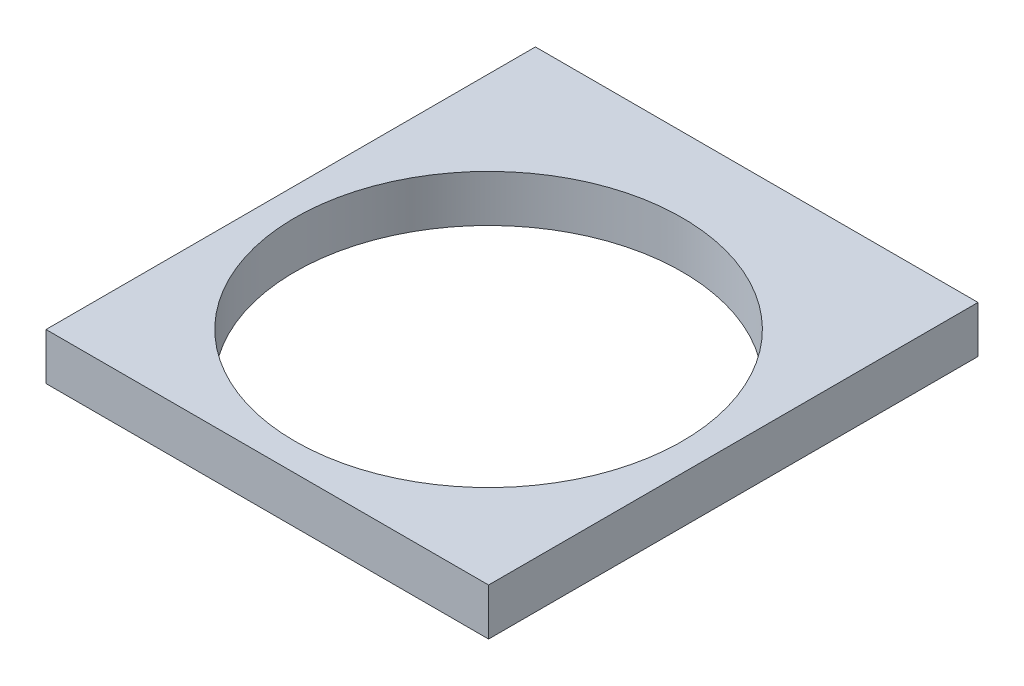
ISO-10303-21;
HEADER;
FILE_DESCRIPTION(('STEP AP214'),'2;1');
FILE_NAME('part.step','',(''),(''),'','','');
FILE_SCHEMA(('AUTOMOTIVE_DESIGN { 1 0 10303 214 1 1 1 1 }'));
ENDSEC;
DATA;
#1=APPLICATION_CONTEXT('core data for automotive mechanical design processes');
#2=APPLICATION_PROTOCOL_DEFINITION('international standard','automotive_design',2000,#1);
#3=PRODUCT_CONTEXT('',#1,'mechanical');
#4=PRODUCT('Part','Part','',(#3));
#5=PRODUCT_RELATED_PRODUCT_CATEGORY('part','',(#4));
#6=PRODUCT_DEFINITION_FORMATION('','',#4);
#7=PRODUCT_DEFINITION_CONTEXT('part definition',#1,'design');
#8=PRODUCT_DEFINITION('design','',#6,#7);
#9=PRODUCT_DEFINITION_SHAPE('','',#8);
#10=(LENGTH_UNIT() NAMED_UNIT(*) SI_UNIT(.MILLI.,.METRE.));
#11=(NAMED_UNIT(*) PLANE_ANGLE_UNIT() SI_UNIT($,.RADIAN.));
#12=(NAMED_UNIT(*) SI_UNIT($,.STERADIAN.) SOLID_ANGLE_UNIT());
#13=UNCERTAINTY_MEASURE_WITH_UNIT(LENGTH_MEASURE(1.E-05),#10,'distance_accuracy_value','');
#14=(GEOMETRIC_REPRESENTATION_CONTEXT(3) GLOBAL_UNCERTAINTY_ASSIGNED_CONTEXT((#13)) GLOBAL_UNIT_ASSIGNED_CONTEXT((#10,
#11,#12)) REPRESENTATION_CONTEXT('',''));
#15=CARTESIAN_POINT('',(0.,0.,0.));
#16=DIRECTION('',(0.,0.,1.));
#17=DIRECTION('',(1.,0.,0.));
#18=AXIS2_PLACEMENT_3D('',#15,#16,#17);
#19=CARTESIAN_POINT('',(0.,6.35,0.));
#20=DIRECTION('',(0.,-1.,0.));
#21=DIRECTION('',(0.,0.,-1.));
#22=AXIS2_PLACEMENT_3D('',#19,#20,#21);
#23=PLANE('',#22);
#24=DIRECTION('',(0.,0.,1.));
#25=VECTOR('',#24,1.);
#26=CARTESIAN_POINT('',(-30.,6.35,30.));
#27=LINE('',#26,#25);
#28=CARTESIAN_POINT('',(-30.,6.35,-36.35));
#29=VERTEX_POINT('',#28);
#30=CARTESIAN_POINT('',(-30.,6.35,30.));
#31=VERTEX_POINT('',#30);
#32=EDGE_CURVE('E50',#29,#31,#27,.T.);
#33=ORIENTED_EDGE('',*,*,#32,.T.);
#34=DIRECTION('',(1.,0.,0.));
#35=VECTOR('',#34,1.);
#36=CARTESIAN_POINT('',(30.,6.35,30.));
#37=LINE('',#36,#35);
#38=CARTESIAN_POINT('',(30.,6.35,30.));
#39=VERTEX_POINT('',#38);
#40=EDGE_CURVE('E80',#31,#39,#37,.T.);
#41=ORIENTED_EDGE('',*,*,#40,.T.);
#42=DIRECTION('',(0.,0.,-1.));
#43=VECTOR('',#42,1.);
#44=CARTESIAN_POINT('',(30.,6.35,30.));
#45=LINE('',#44,#43);
#46=CARTESIAN_POINT('',(30.,6.35,-36.35));
#47=VERTEX_POINT('',#46);
#48=EDGE_CURVE('E84',#39,#47,#45,.T.);
#49=ORIENTED_EDGE('',*,*,#48,.T.);
#50=DIRECTION('',(-1.,0.,0.));
#51=VECTOR('',#50,1.);
#52=CARTESIAN_POINT('',(-30.,6.35,-36.35));
#53=LINE('',#52,#51);
#54=EDGE_CURVE('E92',#47,#29,#53,.T.);
#55=ORIENTED_EDGE('',*,*,#54,.T.);
#56=EDGE_LOOP('',(#33,#41,#49,#55));
#57=FACE_BOUND('',#56,.T.);
#58=CARTESIAN_POINT('',(0.,6.35,0.));
#59=DIRECTION('',(0.,1.,0.));
#60=DIRECTION('',(0.,0.,1.));
#61=AXIS2_PLACEMENT_3D('',#58,#59,#60);
#62=CIRCLE('',#61,26.25);
#63=CARTESIAN_POINT('',(0.,6.35,26.25));
#64=VERTEX_POINT('',#63);
#65=EDGE_CURVE('E99',#64,#64,#62,.T.);
#66=ORIENTED_EDGE('',*,*,#65,.F.);
#67=EDGE_LOOP('',(#66));
#68=FACE_BOUND('',#67,.T.);
#69=ADVANCED_FACE('F33',(#57,#68),#23,.F.);
#70=CARTESIAN_POINT('',(0.,0.,0.));
#71=DIRECTION('',(0.,-1.,0.));
#72=DIRECTION('',(0.,0.,-1.));
#73=AXIS2_PLACEMENT_3D('',#70,#71,#72);
#74=PLANE('',#73);
#75=DIRECTION('',(1.,0.,0.));
#76=VECTOR('',#75,1.);
#77=CARTESIAN_POINT('',(30.,0.,30.));
#78=LINE('',#77,#76);
#79=CARTESIAN_POINT('',(-30.,0.,30.));
#80=VERTEX_POINT('',#79);
#81=CARTESIAN_POINT('',(30.,0.,30.));
#82=VERTEX_POINT('',#81);
#83=EDGE_CURVE('E88',#80,#82,#78,.T.);
#84=ORIENTED_EDGE('',*,*,#83,.F.);
#85=DIRECTION('',(0.,0.,1.));
#86=VECTOR('',#85,1.);
#87=CARTESIAN_POINT('',(-30.,0.,-30.));
#88=LINE('',#87,#86);
#89=CARTESIAN_POINT('',(-30.,0.,-36.35));
#90=VERTEX_POINT('',#89);
#91=EDGE_CURVE('E102',#90,#80,#88,.T.);
#92=ORIENTED_EDGE('',*,*,#91,.F.);
#93=DIRECTION('',(-1.,0.,0.));
#94=VECTOR('',#93,1.);
#95=CARTESIAN_POINT('',(-30.,0.,-36.35));
#96=LINE('',#95,#94);
#97=CARTESIAN_POINT('',(30.,0.,-36.35));
#98=VERTEX_POINT('',#97);
#99=EDGE_CURVE('E74',#98,#90,#96,.T.);
#100=ORIENTED_EDGE('',*,*,#99,.F.);
#101=DIRECTION('',(0.,0.,-1.));
#102=VECTOR('',#101,1.);
#103=CARTESIAN_POINT('',(30.,0.,-36.35));
#104=LINE('',#103,#102);
#105=EDGE_CURVE('E67',#82,#98,#104,.T.);
#106=ORIENTED_EDGE('',*,*,#105,.F.);
#107=EDGE_LOOP('',(#84,#92,#100,#106));
#108=FACE_BOUND('',#107,.T.);
#109=CARTESIAN_POINT('',(0.,0.,0.));
#110=DIRECTION('',(0.,1.,0.));
#111=DIRECTION('',(0.,0.,1.));
#112=AXIS2_PLACEMENT_3D('',#109,#110,#111);
#113=CIRCLE('',#112,26.25);
#114=CARTESIAN_POINT('',(0.,0.,26.25));
#115=VERTEX_POINT('',#114);
#116=EDGE_CURVE('E178',#115,#115,#113,.T.);
#117=ORIENTED_EDGE('',*,*,#116,.T.);
#118=EDGE_LOOP('',(#117));
#119=FACE_BOUND('',#118,.T.);
#120=ADVANCED_FACE('F108',(#108,#119),#74,.T.);
#121=CARTESIAN_POINT('',(30.,6.35,30.));
#122=DIRECTION('',(0.,0.,-1.));
#123=DIRECTION('',(-1.,0.,0.));
#124=AXIS2_PLACEMENT_3D('',#121,#122,#123);
#125=PLANE('',#124);
#126=ORIENTED_EDGE('',*,*,#83,.T.);
#127=DIRECTION('',(0.,-1.,0.));
#128=VECTOR('',#127,1.);
#129=CARTESIAN_POINT('',(30.,6.35,30.));
#130=LINE('',#129,#128);
#131=EDGE_CURVE('E42',#39,#82,#130,.T.);
#132=ORIENTED_EDGE('',*,*,#131,.F.);
#133=ORIENTED_EDGE('',*,*,#40,.F.);
#134=DIRECTION('',(0.,-1.,0.));
#135=VECTOR('',#134,1.);
#136=CARTESIAN_POINT('',(-30.,6.35,30.));
#137=LINE('',#136,#135);
#138=EDGE_CURVE('E11',#31,#80,#137,.T.);
#139=ORIENTED_EDGE('',*,*,#138,.T.);
#140=EDGE_LOOP('',(#126,#132,#133,#139));
#141=FACE_BOUND('',#140,.T.);
#142=ADVANCED_FACE('F35',(#141),#125,.F.);
#143=CARTESIAN_POINT('',(30.,6.35,-36.35));
#144=DIRECTION('',(-1.,0.,0.));
#145=DIRECTION('',(0.,0.,1.));
#146=AXIS2_PLACEMENT_3D('',#143,#144,#145);
#147=PLANE('',#146);
#148=ORIENTED_EDGE('',*,*,#105,.T.);
#149=DIRECTION('',(0.,-1.,0.));
#150=VECTOR('',#149,1.);
#151=CARTESIAN_POINT('',(30.,6.35,-36.35));
#152=LINE('',#151,#150);
#153=EDGE_CURVE('E89',#47,#98,#152,.T.);
#154=ORIENTED_EDGE('',*,*,#153,.F.);
#155=ORIENTED_EDGE('',*,*,#48,.F.);
#156=ORIENTED_EDGE('',*,*,#131,.T.);
#157=EDGE_LOOP('',(#148,#154,#155,#156));
#158=FACE_BOUND('',#157,.T.);
#159=ADVANCED_FACE('F90',(#158),#147,.F.);
#160=CARTESIAN_POINT('',(-30.,6.35,-36.35));
#161=DIRECTION('',(0.,0.,1.));
#162=DIRECTION('',(1.,0.,0.));
#163=AXIS2_PLACEMENT_3D('',#160,#161,#162);
#164=PLANE('',#163);
#165=ORIENTED_EDGE('',*,*,#99,.T.);
#166=DIRECTION('',(0.,-1.,0.));
#167=VECTOR('',#166,1.);
#168=CARTESIAN_POINT('',(-30.,6.35,-36.35));
#169=LINE('',#168,#167);
#170=EDGE_CURVE('E94',#29,#90,#169,.T.);
#171=ORIENTED_EDGE('',*,*,#170,.F.);
#172=ORIENTED_EDGE('',*,*,#54,.F.);
#173=ORIENTED_EDGE('',*,*,#153,.T.);
#174=EDGE_LOOP('',(#165,#171,#172,#173));
#175=FACE_BOUND('',#174,.T.);
#176=ADVANCED_FACE('F105',(#175),#164,.F.);
#177=CARTESIAN_POINT('',(-30.,6.35,-30.));
#178=DIRECTION('',(1.,0.,0.));
#179=DIRECTION('',(0.,0.,-1.));
#180=AXIS2_PLACEMENT_3D('',#177,#178,#179);
#181=PLANE('',#180);
#182=ORIENTED_EDGE('',*,*,#91,.T.);
#183=ORIENTED_EDGE('',*,*,#138,.F.);
#184=ORIENTED_EDGE('',*,*,#32,.F.);
#185=ORIENTED_EDGE('',*,*,#170,.T.);
#186=EDGE_LOOP('',(#182,#183,#184,#185));
#187=FACE_BOUND('',#186,.T.);
#188=ADVANCED_FACE('F110',(#187),#181,.F.);
#189=CARTESIAN_POINT('',(0.,6.35,0.));
#190=DIRECTION('',(0.,-1.,0.));
#191=DIRECTION('',(0.,0.,-1.));
#192=AXIS2_PLACEMENT_3D('',#189,#190,#191);
#193=CYLINDRICAL_SURFACE('',#192,26.25);
#194=ORIENTED_EDGE('',*,*,#65,.T.);
#195=EDGE_LOOP('',(#194));
#196=FACE_BOUND('',#195,.T.);
#197=ORIENTED_EDGE('',*,*,#116,.F.);
#198=EDGE_LOOP('',(#197));
#199=FACE_BOUND('',#198,.T.);
#200=ADVANCED_FACE('F112',(#196,#199),#193,.F.);
#201=CLOSED_SHELL('',(#69,#120,#142,#159,#176,#188,#200));
#202=MANIFOLD_SOLID_BREP('B2',#201);
#203=ADVANCED_BREP_SHAPE_REPRESENTATION('',(#18,#202),#14);
#204=SHAPE_DEFINITION_REPRESENTATION(#9,#203);
ENDSEC;
END-ISO-10303-21;
